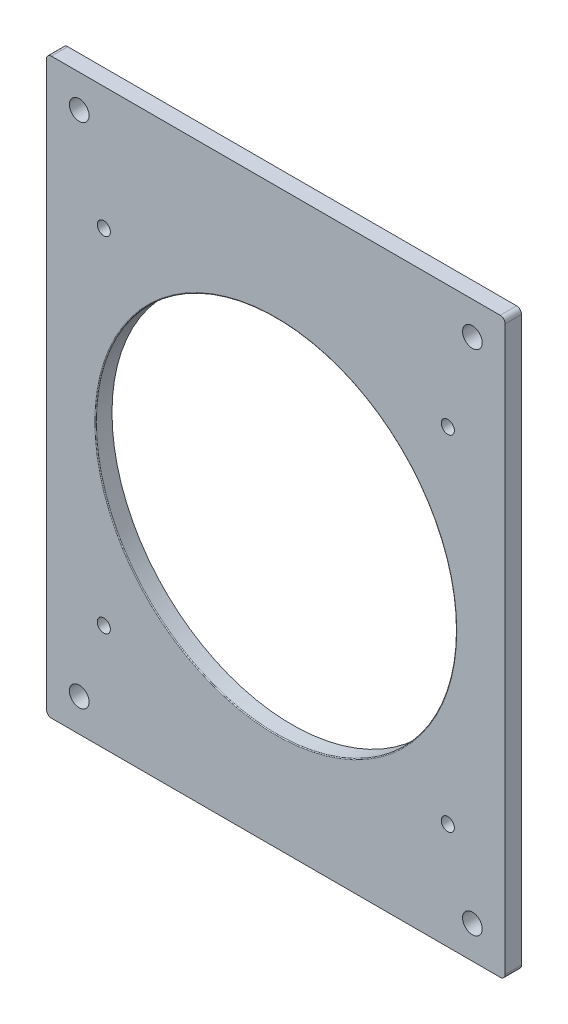
ISO-10303-21;
HEADER;
FILE_DESCRIPTION(('STEP AP214'),'2;1');
FILE_NAME('part.step','',(''),(''),'','','');
FILE_SCHEMA(('AUTOMOTIVE_DESIGN { 1 0 10303 214 1 1 1 1 }'));
ENDSEC;
DATA;
#1=APPLICATION_CONTEXT('core data for automotive mechanical design processes');
#2=APPLICATION_PROTOCOL_DEFINITION('international standard','automotive_design',2000,#1);
#3=PRODUCT_CONTEXT('',#1,'mechanical');
#4=PRODUCT('Part','Part','',(#3));
#5=PRODUCT_RELATED_PRODUCT_CATEGORY('part','',(#4));
#6=PRODUCT_DEFINITION_FORMATION('','',#4);
#7=PRODUCT_DEFINITION_CONTEXT('part definition',#1,'design');
#8=PRODUCT_DEFINITION('design','',#6,#7);
#9=PRODUCT_DEFINITION_SHAPE('','',#8);
#10=(LENGTH_UNIT() NAMED_UNIT(*) SI_UNIT(.MILLI.,.METRE.));
#11=(NAMED_UNIT(*) PLANE_ANGLE_UNIT() SI_UNIT($,.RADIAN.));
#12=(NAMED_UNIT(*) SI_UNIT($,.STERADIAN.) SOLID_ANGLE_UNIT());
#13=UNCERTAINTY_MEASURE_WITH_UNIT(LENGTH_MEASURE(1.E-05),#10,'distance_accuracy_value','');
#14=(GEOMETRIC_REPRESENTATION_CONTEXT(3) GLOBAL_UNCERTAINTY_ASSIGNED_CONTEXT((#13)) GLOBAL_UNIT_ASSIGNED_CONTEXT((#10,
#11,#12)) REPRESENTATION_CONTEXT('',''));
#15=CARTESIAN_POINT('',(0.,0.,0.));
#16=DIRECTION('',(0.,0.,1.));
#17=DIRECTION('',(1.,0.,0.));
#18=AXIS2_PLACEMENT_3D('',#15,#16,#17);
#19=CARTESIAN_POINT('',(68.,-87.5,5.));
#20=DIRECTION('',(0.,1.,0.));
#21=DIRECTION('',(0.,0.,1.));
#22=AXIS2_PLACEMENT_3D('',#19,#20,#21);
#23=PLANE('',#22);
#24=DIRECTION('',(1.,0.,0.));
#25=VECTOR('',#24,1.);
#26=CARTESIAN_POINT('',(68.,-87.5,0.));
#27=LINE('',#26,#25);
#28=CARTESIAN_POINT('',(-68.5,-87.5,0.));
#29=VERTEX_POINT('',#28);
#30=CARTESIAN_POINT('',(68.5,-87.5,0.));
#31=VERTEX_POINT('',#30);
#32=EDGE_CURVE('E98',#29,#31,#27,.T.);
#33=ORIENTED_EDGE('',*,*,#32,.T.);
#34=DIRECTION('',(0.,0.,-1.));
#35=VECTOR('',#34,1.);
#36=CARTESIAN_POINT('',(68.5,-87.5,5.));
#37=LINE('',#36,#35);
#38=CARTESIAN_POINT('',(68.5,-87.5,5.));
#39=VERTEX_POINT('',#38);
#40=EDGE_CURVE('E192',#39,#31,#37,.T.);
#41=ORIENTED_EDGE('',*,*,#40,.F.);
#42=DIRECTION('',(1.,0.,0.));
#43=VECTOR('',#42,1.);
#44=CARTESIAN_POINT('',(-68.,-87.5,5.));
#45=LINE('',#44,#43);
#46=CARTESIAN_POINT('',(-68.5,-87.5,5.));
#47=VERTEX_POINT('',#46);
#48=EDGE_CURVE('E104',#47,#39,#45,.T.);
#49=ORIENTED_EDGE('',*,*,#48,.F.);
#50=DIRECTION('',(0.,0.,-1.));
#51=VECTOR('',#50,1.);
#52=CARTESIAN_POINT('',(-68.5,-87.5,5.));
#53=LINE('',#52,#51);
#54=EDGE_CURVE('E148',#47,#29,#53,.T.);
#55=ORIENTED_EDGE('',*,*,#54,.T.);
#56=EDGE_LOOP('',(#33,#41,#49,#55));
#57=FACE_BOUND('',#56,.T.);
#58=ADVANCED_FACE('F38',(#57),#23,.F.);
#59=CARTESIAN_POINT('',(68.5,-86.,5.));
#60=DIRECTION('',(0.,0.,-1.));
#61=DIRECTION('',(-1.,0.,0.));
#62=AXIS2_PLACEMENT_3D('',#59,#60,#61);
#63=CYLINDRICAL_SURFACE('',#62,1.49999999999999);
#64=CARTESIAN_POINT('',(68.5,-86.,0.));
#65=DIRECTION('',(0.,0.,1.));
#66=DIRECTION('',(1.,0.,0.));
#67=AXIS2_PLACEMENT_3D('',#64,#65,#66);
#68=CIRCLE('',#67,1.49999999999999);
#69=CARTESIAN_POINT('',(70.,-86.,0.));
#70=VERTEX_POINT('',#69);
#71=EDGE_CURVE('E154',#31,#70,#68,.T.);
#72=ORIENTED_EDGE('',*,*,#71,.T.);
#73=DIRECTION('',(0.,0.,-1.));
#74=VECTOR('',#73,1.);
#75=CARTESIAN_POINT('',(70.,-86.,5.));
#76=LINE('',#75,#74);
#77=CARTESIAN_POINT('',(70.,-86.,5.));
#78=VERTEX_POINT('',#77);
#79=EDGE_CURVE('E189',#78,#70,#76,.T.);
#80=ORIENTED_EDGE('',*,*,#79,.F.);
#81=CARTESIAN_POINT('',(68.5,-86.,5.));
#82=DIRECTION('',(0.,0.,1.));
#83=DIRECTION('',(1.,0.,0.));
#84=AXIS2_PLACEMENT_3D('',#81,#82,#83);
#85=CIRCLE('',#84,1.49999999999999);
#86=EDGE_CURVE('E345',#39,#78,#85,.T.);
#87=ORIENTED_EDGE('',*,*,#86,.F.);
#88=ORIENTED_EDGE('',*,*,#40,.T.);
#89=EDGE_LOOP('',(#72,#80,#87,#88));
#90=FACE_BOUND('',#89,.T.);
#91=ADVANCED_FACE('F227',(#90),#63,.T.);
#92=CARTESIAN_POINT('',(70.,86.,5.));
#93=DIRECTION('',(-1.,0.,0.));
#94=DIRECTION('',(0.,-1.,0.));
#95=AXIS2_PLACEMENT_3D('',#92,#93,#94);
#96=PLANE('',#95);
#97=DIRECTION('',(0.,1.,0.));
#98=VECTOR('',#97,1.);
#99=CARTESIAN_POINT('',(70.,86.,0.));
#100=LINE('',#99,#98);
#101=CARTESIAN_POINT('',(70.,86.,0.));
#102=VERTEX_POINT('',#101);
#103=EDGE_CURVE('E158',#70,#102,#100,.T.);
#104=ORIENTED_EDGE('',*,*,#103,.T.);
#105=DIRECTION('',(0.,0.,-1.));
#106=VECTOR('',#105,1.);
#107=CARTESIAN_POINT('',(70.,86.,5.));
#108=LINE('',#107,#106);
#109=CARTESIAN_POINT('',(70.,86.,5.));
#110=VERTEX_POINT('',#109);
#111=EDGE_CURVE('E185',#110,#102,#108,.T.);
#112=ORIENTED_EDGE('',*,*,#111,.F.);
#113=DIRECTION('',(0.,1.,0.));
#114=VECTOR('',#113,1.);
#115=CARTESIAN_POINT('',(70.,-86.,5.));
#116=LINE('',#115,#114);
#117=EDGE_CURVE('E347',#78,#110,#116,.T.);
#118=ORIENTED_EDGE('',*,*,#117,.F.);
#119=ORIENTED_EDGE('',*,*,#79,.T.);
#120=EDGE_LOOP('',(#104,#112,#118,#119));
#121=FACE_BOUND('',#120,.T.);
#122=ADVANCED_FACE('F232',(#121),#96,.F.);
#123=CARTESIAN_POINT('',(68.5,86.,5.));
#124=DIRECTION('',(0.,0.,-1.));
#125=DIRECTION('',(-1.,0.,0.));
#126=AXIS2_PLACEMENT_3D('',#123,#124,#125);
#127=CYLINDRICAL_SURFACE('',#126,1.49999999999999);
#128=CARTESIAN_POINT('',(68.5,86.,0.));
#129=DIRECTION('',(0.,0.,1.));
#130=DIRECTION('',(-1.,0.,0.));
#131=AXIS2_PLACEMENT_3D('',#128,#129,#130);
#132=CIRCLE('',#131,1.49999999999999);
#133=CARTESIAN_POINT('',(68.5,87.5,0.));
#134=VERTEX_POINT('',#133);
#135=EDGE_CURVE('E160',#102,#134,#132,.T.);
#136=ORIENTED_EDGE('',*,*,#135,.T.);
#137=DIRECTION('',(0.,0.,-1.));
#138=VECTOR('',#137,1.);
#139=CARTESIAN_POINT('',(68.5,87.5,5.));
#140=LINE('',#139,#138);
#141=CARTESIAN_POINT('',(68.5,87.5,5.));
#142=VERTEX_POINT('',#141);
#143=EDGE_CURVE('E181',#142,#134,#140,.T.);
#144=ORIENTED_EDGE('',*,*,#143,.F.);
#145=CARTESIAN_POINT('',(68.5,86.,5.));
#146=DIRECTION('',(0.,0.,1.));
#147=DIRECTION('',(-1.,0.,0.));
#148=AXIS2_PLACEMENT_3D('',#145,#146,#147);
#149=CIRCLE('',#148,1.49999999999999);
#150=EDGE_CURVE('E349',#110,#142,#149,.T.);
#151=ORIENTED_EDGE('',*,*,#150,.F.);
#152=ORIENTED_EDGE('',*,*,#111,.T.);
#153=EDGE_LOOP('',(#136,#144,#151,#152));
#154=FACE_BOUND('',#153,.T.);
#155=ADVANCED_FACE('F238',(#154),#127,.T.);
#156=CARTESIAN_POINT('',(-68.,87.5,5.));
#157=DIRECTION('',(0.,-1.,0.));
#158=DIRECTION('',(0.,0.,-1.));
#159=AXIS2_PLACEMENT_3D('',#156,#157,#158);
#160=PLANE('',#159);
#161=DIRECTION('',(-1.,0.,0.));
#162=VECTOR('',#161,1.);
#163=CARTESIAN_POINT('',(-68.,87.5,0.));
#164=LINE('',#163,#162);
#165=CARTESIAN_POINT('',(-68.5,87.5,0.));
#166=VERTEX_POINT('',#165);
#167=EDGE_CURVE('E164',#134,#166,#164,.T.);
#168=ORIENTED_EDGE('',*,*,#167,.T.);
#169=DIRECTION('',(0.,0.,-1.));
#170=VECTOR('',#169,1.);
#171=CARTESIAN_POINT('',(-68.5,87.5,5.));
#172=LINE('',#171,#170);
#173=CARTESIAN_POINT('',(-68.5,87.5,5.));
#174=VERTEX_POINT('',#173);
#175=EDGE_CURVE('E139',#174,#166,#172,.T.);
#176=ORIENTED_EDGE('',*,*,#175,.F.);
#177=DIRECTION('',(-1.,0.,0.));
#178=VECTOR('',#177,1.);
#179=CARTESIAN_POINT('',(68.,87.5,5.));
#180=LINE('',#179,#178);
#181=EDGE_CURVE('E127',#142,#174,#180,.T.);
#182=ORIENTED_EDGE('',*,*,#181,.F.);
#183=ORIENTED_EDGE('',*,*,#143,.T.);
#184=EDGE_LOOP('',(#168,#176,#182,#183));
#185=FACE_BOUND('',#184,.T.);
#186=ADVANCED_FACE('F242',(#185),#160,.F.);
#187=CARTESIAN_POINT('',(-68.5,86.,5.));
#188=DIRECTION('',(0.,0.,-1.));
#189=DIRECTION('',(-1.,0.,0.));
#190=AXIS2_PLACEMENT_3D('',#187,#188,#189);
#191=CYLINDRICAL_SURFACE('',#190,1.5);
#192=CARTESIAN_POINT('',(-68.5,86.,0.));
#193=DIRECTION('',(0.,0.,1.));
#194=DIRECTION('',(1.,0.,0.));
#195=AXIS2_PLACEMENT_3D('',#192,#193,#194);
#196=CIRCLE('',#195,1.5);
#197=CARTESIAN_POINT('',(-70.,86.,0.));
#198=VERTEX_POINT('',#197);
#199=EDGE_CURVE('E137',#166,#198,#196,.T.);
#200=ORIENTED_EDGE('',*,*,#199,.T.);
#201=DIRECTION('',(0.,0.,-1.));
#202=VECTOR('',#201,1.);
#203=CARTESIAN_POINT('',(-70.,86.,5.));
#204=LINE('',#203,#202);
#205=CARTESIAN_POINT('',(-70.,86.,5.));
#206=VERTEX_POINT('',#205);
#207=EDGE_CURVE('E134',#206,#198,#204,.T.);
#208=ORIENTED_EDGE('',*,*,#207,.F.);
#209=CARTESIAN_POINT('',(-68.5,86.,5.));
#210=DIRECTION('',(0.,0.,1.));
#211=DIRECTION('',(1.,0.,0.));
#212=AXIS2_PLACEMENT_3D('',#209,#210,#211);
#213=CIRCLE('',#212,1.5);
#214=EDGE_CURVE('E121',#174,#206,#213,.T.);
#215=ORIENTED_EDGE('',*,*,#214,.F.);
#216=ORIENTED_EDGE('',*,*,#175,.T.);
#217=EDGE_LOOP('',(#200,#208,#215,#216));
#218=FACE_BOUND('',#217,.T.);
#219=ADVANCED_FACE('F135',(#218),#191,.T.);
#220=CARTESIAN_POINT('',(-70.,-86.,5.));
#221=DIRECTION('',(1.,0.,0.));
#222=DIRECTION('',(0.,0.,-1.));
#223=AXIS2_PLACEMENT_3D('',#220,#221,#222);
#224=PLANE('',#223);
#225=DIRECTION('',(0.,-1.,0.));
#226=VECTOR('',#225,1.);
#227=CARTESIAN_POINT('',(-70.,-86.,0.));
#228=LINE('',#227,#226);
#229=CARTESIAN_POINT('',(-70.,-86.,0.));
#230=VERTEX_POINT('',#229);
#231=EDGE_CURVE('E91',#198,#230,#228,.T.);
#232=ORIENTED_EDGE('',*,*,#231,.T.);
#233=DIRECTION('',(0.,0.,-1.));
#234=VECTOR('',#233,1.);
#235=CARTESIAN_POINT('',(-70.,-86.,5.));
#236=LINE('',#235,#234);
#237=CARTESIAN_POINT('',(-70.,-86.,5.));
#238=VERTEX_POINT('',#237);
#239=EDGE_CURVE('E140',#238,#230,#236,.T.);
#240=ORIENTED_EDGE('',*,*,#239,.F.);
#241=DIRECTION('',(0.,-1.,0.));
#242=VECTOR('',#241,1.);
#243=CARTESIAN_POINT('',(-70.,86.,5.));
#244=LINE('',#243,#242);
#245=EDGE_CURVE('E125',#206,#238,#244,.T.);
#246=ORIENTED_EDGE('',*,*,#245,.F.);
#247=ORIENTED_EDGE('',*,*,#207,.T.);
#248=EDGE_LOOP('',(#232,#240,#246,#247));
#249=FACE_BOUND('',#248,.T.);
#250=ADVANCED_FACE('F142',(#249),#224,.F.);
#251=CARTESIAN_POINT('',(-68.5,-86.,5.));
#252=DIRECTION('',(0.,0.,-1.));
#253=DIRECTION('',(-1.,0.,0.));
#254=AXIS2_PLACEMENT_3D('',#251,#252,#253);
#255=CYLINDRICAL_SURFACE('',#254,1.5);
#256=CARTESIAN_POINT('',(-68.5,-86.,0.));
#257=DIRECTION('',(0.,0.,1.));
#258=DIRECTION('',(-1.,0.,0.));
#259=AXIS2_PLACEMENT_3D('',#256,#257,#258);
#260=CIRCLE('',#259,1.5);
#261=EDGE_CURVE('E171',#230,#29,#260,.T.);
#262=ORIENTED_EDGE('',*,*,#261,.T.);
#263=ORIENTED_EDGE('',*,*,#54,.F.);
#264=CARTESIAN_POINT('',(-68.5,-86.,5.));
#265=DIRECTION('',(0.,0.,1.));
#266=DIRECTION('',(-1.,0.,0.));
#267=AXIS2_PLACEMENT_3D('',#264,#265,#266);
#268=CIRCLE('',#267,1.5);
#269=EDGE_CURVE('E59',#238,#47,#268,.T.);
#270=ORIENTED_EDGE('',*,*,#269,.F.);
#271=ORIENTED_EDGE('',*,*,#239,.T.);
#272=EDGE_LOOP('',(#262,#263,#270,#271));
#273=FACE_BOUND('',#272,.T.);
#274=ADVANCED_FACE('F251',(#273),#255,.T.);
#275=CARTESIAN_POINT('',(-68.5,-86.,5.));
#276=DIRECTION('',(0.,0.,-1.));
#277=DIRECTION('',(-1.,0.,0.));
#278=AXIS2_PLACEMENT_3D('',#275,#276,#277);
#279=PLANE('',#278);
#280=CARTESIAN_POINT('',(0.,-2.50000000000044,5.));
#281=DIRECTION('',(0.,0.,-1.));
#282=DIRECTION('',(-1.,0.,0.));
#283=AXIS2_PLACEMENT_3D('',#280,#281,#282);
#284=CIRCLE('',#283,55.25);
#285=CARTESIAN_POINT('',(-55.25,-2.50000000000044,5.));
#286=VERTEX_POINT('',#285);
#287=EDGE_CURVE('E48',#286,#286,#284,.T.);
#288=ORIENTED_EDGE('',*,*,#287,.T.);
#289=EDGE_LOOP('',(#288));
#290=FACE_BOUND('',#289,.T.);
#291=CARTESIAN_POINT('',(-52.5,49.9999999999996,5.));
#292=DIRECTION('',(0.,0.,-1.));
#293=DIRECTION('',(-1.,0.,0.));
#294=AXIS2_PLACEMENT_3D('',#291,#292,#293);
#295=CIRCLE('',#294,2.);
#296=CARTESIAN_POINT('',(-54.5,49.9999999999996,5.));
#297=VERTEX_POINT('',#296);
#298=EDGE_CURVE('E325',#297,#297,#295,.T.);
#299=ORIENTED_EDGE('',*,*,#298,.T.);
#300=EDGE_LOOP('',(#299));
#301=FACE_BOUND('',#300,.T.);
#302=CARTESIAN_POINT('',(-52.5,-55.0000000000004,5.));
#303=DIRECTION('',(0.,0.,-1.));
#304=DIRECTION('',(-1.,0.,0.));
#305=AXIS2_PLACEMENT_3D('',#302,#303,#304);
#306=CIRCLE('',#305,2.);
#307=CARTESIAN_POINT('',(-54.5,-55.0000000000004,5.));
#308=VERTEX_POINT('',#307);
#309=EDGE_CURVE('E321',#308,#308,#306,.T.);
#310=ORIENTED_EDGE('',*,*,#309,.T.);
#311=EDGE_LOOP('',(#310));
#312=FACE_BOUND('',#311,.T.);
#313=CARTESIAN_POINT('',(52.5,-55.0000000000004,5.));
#314=DIRECTION('',(0.,0.,-1.));
#315=DIRECTION('',(-1.,0.,0.));
#316=AXIS2_PLACEMENT_3D('',#313,#314,#315);
#317=CIRCLE('',#316,2.);
#318=CARTESIAN_POINT('',(50.5,-55.0000000000004,5.));
#319=VERTEX_POINT('',#318);
#320=EDGE_CURVE('E318',#319,#319,#317,.T.);
#321=ORIENTED_EDGE('',*,*,#320,.T.);
#322=EDGE_LOOP('',(#321));
#323=FACE_BOUND('',#322,.T.);
#324=CARTESIAN_POINT('',(52.5,49.9999999999996,5.));
#325=DIRECTION('',(0.,0.,-1.));
#326=DIRECTION('',(-1.,0.,0.));
#327=AXIS2_PLACEMENT_3D('',#324,#325,#326);
#328=CIRCLE('',#327,2.);
#329=CARTESIAN_POINT('',(50.5,49.9999999999996,5.));
#330=VERTEX_POINT('',#329);
#331=EDGE_CURVE('E314',#330,#330,#328,.T.);
#332=ORIENTED_EDGE('',*,*,#331,.T.);
#333=EDGE_LOOP('',(#332));
#334=FACE_BOUND('',#333,.T.);
#335=CARTESIAN_POINT('',(60.0000000000002,-77.5000000000003,5.));
#336=DIRECTION('',(0.,0.,1.));
#337=DIRECTION('',(1.,0.,0.));
#338=AXIS2_PLACEMENT_3D('',#335,#336,#337);
#339=CIRCLE('',#338,3.00000000000001);
#340=CARTESIAN_POINT('',(63.0000000000002,-77.5000000000003,5.));
#341=VERTEX_POINT('',#340);
#342=EDGE_CURVE('E334',#341,#341,#339,.T.);
#343=ORIENTED_EDGE('',*,*,#342,.F.);
#344=EDGE_LOOP('',(#343));
#345=FACE_BOUND('',#344,.T.);
#346=CARTESIAN_POINT('',(-60.,77.4999999999997,5.));
#347=DIRECTION('',(0.,0.,1.));
#348=DIRECTION('',(1.,0.,0.));
#349=AXIS2_PLACEMENT_3D('',#346,#347,#348);
#350=CIRCLE('',#349,3.);
#351=CARTESIAN_POINT('',(-57.,77.4999999999997,5.));
#352=VERTEX_POINT('',#351);
#353=EDGE_CURVE('E333',#352,#352,#350,.T.);
#354=ORIENTED_EDGE('',*,*,#353,.F.);
#355=EDGE_LOOP('',(#354));
#356=FACE_BOUND('',#355,.T.);
#357=CARTESIAN_POINT('',(60.,77.4999999999997,5.));
#358=DIRECTION('',(0.,0.,1.));
#359=DIRECTION('',(1.,0.,0.));
#360=AXIS2_PLACEMENT_3D('',#357,#358,#359);
#361=CIRCLE('',#360,3.00000000000001);
#362=CARTESIAN_POINT('',(63.,77.4999999999997,5.));
#363=VERTEX_POINT('',#362);
#364=EDGE_CURVE('E329',#363,#363,#361,.T.);
#365=ORIENTED_EDGE('',*,*,#364,.F.);
#366=EDGE_LOOP('',(#365));
#367=FACE_BOUND('',#366,.T.);
#368=CARTESIAN_POINT('',(-60.,-77.5000000000003,5.));
#369=DIRECTION('',(0.,0.,1.));
#370=DIRECTION('',(1.,0.,0.));
#371=AXIS2_PLACEMENT_3D('',#368,#369,#370);
#372=CIRCLE('',#371,3.);
#373=CARTESIAN_POINT('',(-57.,-77.5000000000003,5.));
#374=VERTEX_POINT('',#373);
#375=EDGE_CURVE('E200',#374,#374,#372,.T.);
#376=ORIENTED_EDGE('',*,*,#375,.F.);
#377=EDGE_LOOP('',(#376));
#378=FACE_BOUND('',#377,.T.);
#379=ORIENTED_EDGE('',*,*,#48,.T.);
#380=ORIENTED_EDGE('',*,*,#86,.T.);
#381=ORIENTED_EDGE('',*,*,#117,.T.);
#382=ORIENTED_EDGE('',*,*,#150,.T.);
#383=ORIENTED_EDGE('',*,*,#181,.T.);
#384=ORIENTED_EDGE('',*,*,#214,.T.);
#385=ORIENTED_EDGE('',*,*,#245,.T.);
#386=ORIENTED_EDGE('',*,*,#269,.T.);
#387=EDGE_LOOP('',(#379,#380,#381,#382,#383,#384,#385,#386));
#388=FACE_BOUND('',#387,.T.);
#389=ADVANCED_FACE('F123',(#290,#301,#312,#323,#334,#345,#356,#367,#378,#388),#279,.F.);
#390=CARTESIAN_POINT('',(-68.5,-86.,0.));
#391=DIRECTION('',(0.,0.,-1.));
#392=DIRECTION('',(-1.,0.,0.));
#393=AXIS2_PLACEMENT_3D('',#390,#391,#392);
#394=PLANE('',#393);
#395=CARTESIAN_POINT('',(-52.5,49.9999999999996,0.));
#396=DIRECTION('',(0.,0.,-1.));
#397=DIRECTION('',(-1.,0.,0.));
#398=AXIS2_PLACEMENT_3D('',#395,#396,#397);
#399=CIRCLE('',#398,2.);
#400=CARTESIAN_POINT('',(-54.5,49.9999999999996,0.));
#401=VERTEX_POINT('',#400);
#402=EDGE_CURVE('E304',#401,#401,#399,.T.);
#403=ORIENTED_EDGE('',*,*,#402,.F.);
#404=EDGE_LOOP('',(#403));
#405=FACE_BOUND('',#404,.T.);
#406=CARTESIAN_POINT('',(-52.5,-55.0000000000004,0.));
#407=DIRECTION('',(0.,0.,-1.));
#408=DIRECTION('',(-1.,0.,0.));
#409=AXIS2_PLACEMENT_3D('',#406,#407,#408);
#410=CIRCLE('',#409,2.);
#411=CARTESIAN_POINT('',(-54.5,-55.0000000000004,0.));
#412=VERTEX_POINT('',#411);
#413=EDGE_CURVE('E301',#412,#412,#410,.T.);
#414=ORIENTED_EDGE('',*,*,#413,.F.);
#415=EDGE_LOOP('',(#414));
#416=FACE_BOUND('',#415,.T.);
#417=CARTESIAN_POINT('',(0.,-2.50000000000044,0.));
#418=DIRECTION('',(0.,0.,-1.));
#419=DIRECTION('',(-1.,0.,0.));
#420=AXIS2_PLACEMENT_3D('',#417,#418,#419);
#421=CIRCLE('',#420,55.);
#422=CARTESIAN_POINT('',(-55.,-2.50000000000044,0.));
#423=VERTEX_POINT('',#422);
#424=EDGE_CURVE('E296',#423,#423,#421,.T.);
#425=ORIENTED_EDGE('',*,*,#424,.F.);
#426=EDGE_LOOP('',(#425));
#427=FACE_BOUND('',#426,.T.);
#428=CARTESIAN_POINT('',(52.5,-55.0000000000004,0.));
#429=DIRECTION('',(0.,0.,-1.));
#430=DIRECTION('',(-1.,0.,0.));
#431=AXIS2_PLACEMENT_3D('',#428,#429,#430);
#432=CIRCLE('',#431,2.);
#433=CARTESIAN_POINT('',(50.5,-55.0000000000004,0.));
#434=VERTEX_POINT('',#433);
#435=EDGE_CURVE('E298',#434,#434,#432,.T.);
#436=ORIENTED_EDGE('',*,*,#435,.F.);
#437=EDGE_LOOP('',(#436));
#438=FACE_BOUND('',#437,.T.);
#439=CARTESIAN_POINT('',(52.5,49.9999999999996,0.));
#440=DIRECTION('',(0.,0.,-1.));
#441=DIRECTION('',(-1.,0.,0.));
#442=AXIS2_PLACEMENT_3D('',#439,#440,#441);
#443=CIRCLE('',#442,2.);
#444=CARTESIAN_POINT('',(50.5,49.9999999999996,0.));
#445=VERTEX_POINT('',#444);
#446=EDGE_CURVE('E307',#445,#445,#443,.T.);
#447=ORIENTED_EDGE('',*,*,#446,.F.);
#448=EDGE_LOOP('',(#447));
#449=FACE_BOUND('',#448,.T.);
#450=CARTESIAN_POINT('',(60.0000000000002,-77.5000000000003,0.));
#451=DIRECTION('',(0.,0.,-1.));
#452=DIRECTION('',(-1.,0.,0.));
#453=AXIS2_PLACEMENT_3D('',#450,#451,#452);
#454=CIRCLE('',#453,3.00000000000001);
#455=CARTESIAN_POINT('',(57.0000000000002,-77.5000000000003,0.));
#456=VERTEX_POINT('',#455);
#457=EDGE_CURVE('E155',#456,#456,#454,.T.);
#458=ORIENTED_EDGE('',*,*,#457,.F.);
#459=EDGE_LOOP('',(#458));
#460=FACE_BOUND('',#459,.T.);
#461=CARTESIAN_POINT('',(-60.,77.4999999999997,0.));
#462=DIRECTION('',(0.,0.,-1.));
#463=DIRECTION('',(-1.,0.,0.));
#464=AXIS2_PLACEMENT_3D('',#461,#462,#463);
#465=CIRCLE('',#464,3.);
#466=CARTESIAN_POINT('',(-63.,77.4999999999997,0.));
#467=VERTEX_POINT('',#466);
#468=EDGE_CURVE('E204',#467,#467,#465,.T.);
#469=ORIENTED_EDGE('',*,*,#468,.F.);
#470=EDGE_LOOP('',(#469));
#471=FACE_BOUND('',#470,.T.);
#472=CARTESIAN_POINT('',(60.,77.4999999999997,0.));
#473=DIRECTION('',(0.,0.,-1.));
#474=DIRECTION('',(-1.,0.,0.));
#475=AXIS2_PLACEMENT_3D('',#472,#473,#474);
#476=CIRCLE('',#475,3.00000000000001);
#477=CARTESIAN_POINT('',(57.,77.4999999999997,0.));
#478=VERTEX_POINT('',#477);
#479=EDGE_CURVE('E199',#478,#478,#476,.T.);
#480=ORIENTED_EDGE('',*,*,#479,.F.);
#481=EDGE_LOOP('',(#480));
#482=FACE_BOUND('',#481,.T.);
#483=CARTESIAN_POINT('',(-60.,-77.5000000000003,0.));
#484=DIRECTION('',(0.,0.,-1.));
#485=DIRECTION('',(-1.,0.,0.));
#486=AXIS2_PLACEMENT_3D('',#483,#484,#485);
#487=CIRCLE('',#486,3.);
#488=CARTESIAN_POINT('',(-63.,-77.5000000000003,0.));
#489=VERTEX_POINT('',#488);
#490=EDGE_CURVE('E195',#489,#489,#487,.T.);
#491=ORIENTED_EDGE('',*,*,#490,.F.);
#492=EDGE_LOOP('',(#491));
#493=FACE_BOUND('',#492,.T.);
#494=ORIENTED_EDGE('',*,*,#32,.F.);
#495=ORIENTED_EDGE('',*,*,#261,.F.);
#496=ORIENTED_EDGE('',*,*,#231,.F.);
#497=ORIENTED_EDGE('',*,*,#199,.F.);
#498=ORIENTED_EDGE('',*,*,#167,.F.);
#499=ORIENTED_EDGE('',*,*,#135,.F.);
#500=ORIENTED_EDGE('',*,*,#103,.F.);
#501=ORIENTED_EDGE('',*,*,#71,.F.);
#502=EDGE_LOOP('',(#494,#495,#496,#497,#498,#499,#500,#501));
#503=FACE_BOUND('',#502,.T.);
#504=ADVANCED_FACE('F255',(#405,#416,#427,#438,#449,#460,#471,#482,#493,#503),#394,.T.);
#505=CARTESIAN_POINT('',(-60.,-77.5000000000003,-5.));
#506=DIRECTION('',(0.,0.,1.));
#507=DIRECTION('',(1.,0.,0.));
#508=AXIS2_PLACEMENT_3D('',#505,#506,#507);
#509=CYLINDRICAL_SURFACE('',#508,3.);
#510=ORIENTED_EDGE('',*,*,#490,.T.);
#511=EDGE_LOOP('',(#510));
#512=FACE_BOUND('',#511,.T.);
#513=ORIENTED_EDGE('',*,*,#375,.T.);
#514=EDGE_LOOP('',(#513));
#515=FACE_BOUND('',#514,.T.);
#516=ADVANCED_FACE('F258',(#512,#515),#509,.F.);
#517=CARTESIAN_POINT('',(60.,77.4999999999997,-5.));
#518=DIRECTION('',(0.,0.,1.));
#519=DIRECTION('',(1.,0.,0.));
#520=AXIS2_PLACEMENT_3D('',#517,#518,#519);
#521=CYLINDRICAL_SURFACE('',#520,3.00000000000001);
#522=ORIENTED_EDGE('',*,*,#479,.T.);
#523=EDGE_LOOP('',(#522));
#524=FACE_BOUND('',#523,.T.);
#525=ORIENTED_EDGE('',*,*,#364,.T.);
#526=EDGE_LOOP('',(#525));
#527=FACE_BOUND('',#526,.T.);
#528=ADVANCED_FACE('F264',(#524,#527),#521,.F.);
#529=CARTESIAN_POINT('',(-60.,77.4999999999997,-5.));
#530=DIRECTION('',(0.,0.,1.));
#531=DIRECTION('',(1.,0.,0.));
#532=AXIS2_PLACEMENT_3D('',#529,#530,#531);
#533=CYLINDRICAL_SURFACE('',#532,3.);
#534=ORIENTED_EDGE('',*,*,#468,.T.);
#535=EDGE_LOOP('',(#534));
#536=FACE_BOUND('',#535,.T.);
#537=ORIENTED_EDGE('',*,*,#353,.T.);
#538=EDGE_LOOP('',(#537));
#539=FACE_BOUND('',#538,.T.);
#540=ADVANCED_FACE('F266',(#536,#539),#533,.F.);
#541=CARTESIAN_POINT('',(60.0000000000002,-77.5000000000003,-5.));
#542=DIRECTION('',(0.,0.,1.));
#543=DIRECTION('',(1.,0.,0.));
#544=AXIS2_PLACEMENT_3D('',#541,#542,#543);
#545=CYLINDRICAL_SURFACE('',#544,3.00000000000001);
#546=ORIENTED_EDGE('',*,*,#457,.T.);
#547=EDGE_LOOP('',(#546));
#548=FACE_BOUND('',#547,.T.);
#549=ORIENTED_EDGE('',*,*,#342,.T.);
#550=EDGE_LOOP('',(#549));
#551=FACE_BOUND('',#550,.T.);
#552=ADVANCED_FACE('F269',(#548,#551),#545,.F.);
#553=CARTESIAN_POINT('',(52.5,49.9999999999996,10.));
#554=DIRECTION('',(0.,0.,-1.));
#555=DIRECTION('',(-1.,0.,0.));
#556=AXIS2_PLACEMENT_3D('',#553,#554,#555);
#557=CYLINDRICAL_SURFACE('',#556,2.);
#558=ORIENTED_EDGE('',*,*,#446,.T.);
#559=EDGE_LOOP('',(#558));
#560=FACE_BOUND('',#559,.T.);
#561=ORIENTED_EDGE('',*,*,#331,.F.);
#562=EDGE_LOOP('',(#561));
#563=FACE_BOUND('',#562,.T.);
#564=ADVANCED_FACE('F273',(#560,#563),#557,.F.);
#565=CARTESIAN_POINT('',(52.5,-55.0000000000004,10.));
#566=DIRECTION('',(0.,0.,-1.));
#567=DIRECTION('',(-1.,0.,0.));
#568=AXIS2_PLACEMENT_3D('',#565,#566,#567);
#569=CYLINDRICAL_SURFACE('',#568,2.);
#570=ORIENTED_EDGE('',*,*,#435,.T.);
#571=EDGE_LOOP('',(#570));
#572=FACE_BOUND('',#571,.T.);
#573=ORIENTED_EDGE('',*,*,#320,.F.);
#574=EDGE_LOOP('',(#573));
#575=FACE_BOUND('',#574,.T.);
#576=ADVANCED_FACE('F280',(#572,#575),#569,.F.);
#577=CARTESIAN_POINT('',(0.,-2.50000000000044,10.));
#578=DIRECTION('',(0.,0.,-1.));
#579=DIRECTION('',(-1.,0.,0.));
#580=AXIS2_PLACEMENT_3D('',#577,#578,#579);
#581=CYLINDRICAL_SURFACE('',#580,55.);
#582=CARTESIAN_POINT('',(0.,-2.50000000000044,4.75));
#583=DIRECTION('',(0.,0.,-1.));
#584=DIRECTION('',(-1.,0.,0.));
#585=AXIS2_PLACEMENT_3D('',#582,#583,#584);
#586=CIRCLE('',#585,55.);
#587=CARTESIAN_POINT('',(-55.,-2.50000000000044,4.75));
#588=VERTEX_POINT('',#587);
#589=EDGE_CURVE('E11',#588,#588,#586,.F.);
#590=ORIENTED_EDGE('',*,*,#589,.T.);
#591=EDGE_LOOP('',(#590));
#592=FACE_BOUND('',#591,.T.);
#593=ORIENTED_EDGE('',*,*,#424,.T.);
#594=EDGE_LOOP('',(#593));
#595=FACE_BOUND('',#594,.T.);
#596=ADVANCED_FACE('F283',(#592,#595),#581,.F.);
#597=CARTESIAN_POINT('',(-52.5,-55.0000000000004,10.));
#598=DIRECTION('',(0.,0.,-1.));
#599=DIRECTION('',(-1.,0.,0.));
#600=AXIS2_PLACEMENT_3D('',#597,#598,#599);
#601=CYLINDRICAL_SURFACE('',#600,2.);
#602=ORIENTED_EDGE('',*,*,#413,.T.);
#603=EDGE_LOOP('',(#602));
#604=FACE_BOUND('',#603,.T.);
#605=ORIENTED_EDGE('',*,*,#309,.F.);
#606=EDGE_LOOP('',(#605));
#607=FACE_BOUND('',#606,.T.);
#608=ADVANCED_FACE('F222',(#604,#607),#601,.F.);
#609=CARTESIAN_POINT('',(-52.5,49.9999999999996,10.));
#610=DIRECTION('',(0.,0.,-1.));
#611=DIRECTION('',(-1.,0.,0.));
#612=AXIS2_PLACEMENT_3D('',#609,#610,#611);
#613=CYLINDRICAL_SURFACE('',#612,2.);
#614=ORIENTED_EDGE('',*,*,#402,.T.);
#615=EDGE_LOOP('',(#614));
#616=FACE_BOUND('',#615,.T.);
#617=ORIENTED_EDGE('',*,*,#298,.F.);
#618=EDGE_LOOP('',(#617));
#619=FACE_BOUND('',#618,.T.);
#620=ADVANCED_FACE('F217',(#616,#619),#613,.F.);
#621=CARTESIAN_POINT('',(0.,-2.50000000000044,4.75));
#622=DIRECTION('',(0.,0.,-1.));
#623=DIRECTION('',(-1.,0.,0.));
#624=AXIS2_PLACEMENT_3D('',#621,#622,#623);
#625=TOROIDAL_SURFACE('',#624,55.25,0.25);
#626=ORIENTED_EDGE('',*,*,#589,.F.);
#627=EDGE_LOOP('',(#626));
#628=FACE_BOUND('',#627,.T.);
#629=ORIENTED_EDGE('',*,*,#287,.F.);
#630=EDGE_LOOP('',(#629));
#631=FACE_BOUND('',#630,.T.);
#632=ADVANCED_FACE('F40',(#628,#631),#625,.T.);
#633=CLOSED_SHELL('',(#58,#91,#122,#155,#186,#219,#250,#274,#389,#504,#516,#528,#540,#552,#564,
#576,#596,#608,#620,#632));
#634=MANIFOLD_SOLID_BREP('B2',#633);
#635=ADVANCED_BREP_SHAPE_REPRESENTATION('',(#18,#634),#14);
#636=SHAPE_DEFINITION_REPRESENTATION(#9,#635);
ENDSEC;
END-ISO-10303-21;
